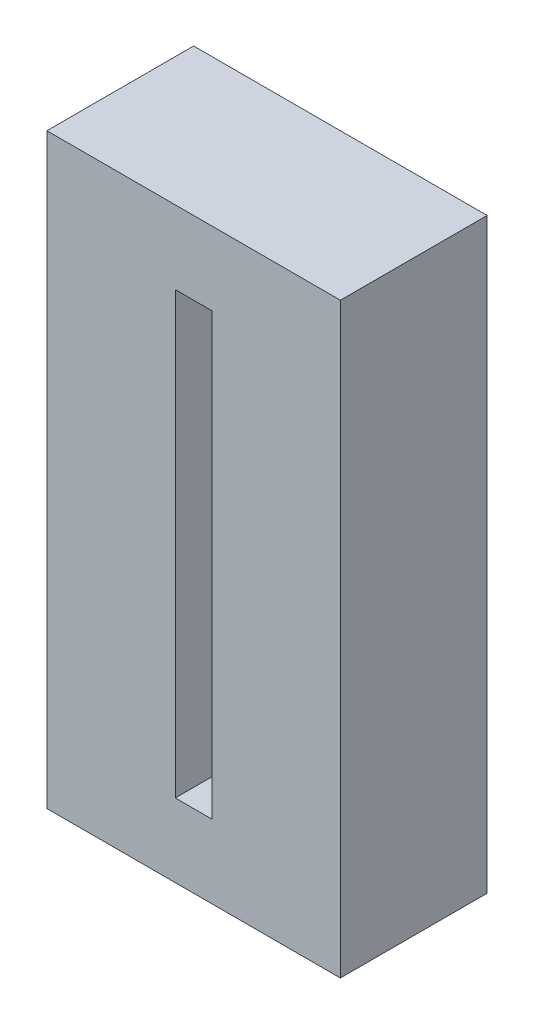
ISO-10303-21;
HEADER;
FILE_DESCRIPTION(('STEP AP214'),'2;1');
FILE_NAME('part.step','',(''),(''),'','','');
FILE_SCHEMA(('AUTOMOTIVE_DESIGN { 1 0 10303 214 1 1 1 1 }'));
ENDSEC;
DATA;
#1=APPLICATION_CONTEXT('core data for automotive mechanical design processes');
#2=APPLICATION_PROTOCOL_DEFINITION('international standard','automotive_design',2000,#1);
#3=PRODUCT_CONTEXT('',#1,'mechanical');
#4=PRODUCT('Part','Part','',(#3));
#5=PRODUCT_RELATED_PRODUCT_CATEGORY('part','',(#4));
#6=PRODUCT_DEFINITION_FORMATION('','',#4);
#7=PRODUCT_DEFINITION_CONTEXT('part definition',#1,'design');
#8=PRODUCT_DEFINITION('design','',#6,#7);
#9=PRODUCT_DEFINITION_SHAPE('','',#8);
#10=(LENGTH_UNIT() NAMED_UNIT(*) SI_UNIT(.MILLI.,.METRE.));
#11=(NAMED_UNIT(*) PLANE_ANGLE_UNIT() SI_UNIT($,.RADIAN.));
#12=(NAMED_UNIT(*) SI_UNIT($,.STERADIAN.) SOLID_ANGLE_UNIT());
#13=UNCERTAINTY_MEASURE_WITH_UNIT(LENGTH_MEASURE(1.E-05),#10,'distance_accuracy_value','');
#14=(GEOMETRIC_REPRESENTATION_CONTEXT(3) GLOBAL_UNCERTAINTY_ASSIGNED_CONTEXT((#13)) GLOBAL_UNIT_ASSIGNED_CONTEXT((#10,
#11,#12)) REPRESENTATION_CONTEXT('',''));
#15=CARTESIAN_POINT('',(0.,0.,0.));
#16=DIRECTION('',(0.,0.,1.));
#17=DIRECTION('',(1.,0.,0.));
#18=AXIS2_PLACEMENT_3D('',#15,#16,#17);
#19=CARTESIAN_POINT('',(0.,203.2,50.8));
#20=DIRECTION('',(0.,0.,-1.));
#21=DIRECTION('',(-1.,0.,0.));
#22=AXIS2_PLACEMENT_3D('',#19,#20,#21);
#23=PLANE('',#22);
#24=DIRECTION('',(0.,-1.,0.));
#25=VECTOR('',#24,1.);
#26=CARTESIAN_POINT('',(0.,0.,50.8));
#27=LINE('',#26,#25);
#28=CARTESIAN_POINT('',(0.,203.2,50.8));
#29=VERTEX_POINT('',#28);
#30=CARTESIAN_POINT('',(0.,0.,50.8));
#31=VERTEX_POINT('',#30);
#32=EDGE_CURVE('E133',#29,#31,#27,.T.);
#33=ORIENTED_EDGE('',*,*,#32,.T.);
#34=DIRECTION('',(1.,0.,0.));
#35=VECTOR('',#34,1.);
#36=CARTESIAN_POINT('',(0.,0.,50.8));
#37=LINE('',#36,#35);
#38=CARTESIAN_POINT('',(101.6,0.,50.8));
#39=VERTEX_POINT('',#38);
#40=EDGE_CURVE('E136',#31,#39,#37,.T.);
#41=ORIENTED_EDGE('',*,*,#40,.T.);
#42=DIRECTION('',(0.,1.,0.));
#43=VECTOR('',#42,1.);
#44=CARTESIAN_POINT('',(101.6,0.,50.8));
#45=LINE('',#44,#43);
#46=CARTESIAN_POINT('',(101.6,203.2,50.8));
#47=VERTEX_POINT('',#46);
#48=EDGE_CURVE('E139',#39,#47,#45,.T.);
#49=ORIENTED_EDGE('',*,*,#48,.T.);
#50=DIRECTION('',(-1.,0.,0.));
#51=VECTOR('',#50,1.);
#52=CARTESIAN_POINT('',(0.,203.2,50.8));
#53=LINE('',#52,#51);
#54=EDGE_CURVE('E141',#47,#29,#53,.T.);
#55=ORIENTED_EDGE('',*,*,#54,.T.);
#56=EDGE_LOOP('',(#33,#41,#49,#55));
#57=FACE_BOUND('',#56,.T.);
#58=DIRECTION('',(0.,-1.,0.));
#59=VECTOR('',#58,1.);
#60=CARTESIAN_POINT('',(44.45,25.4,50.8));
#61=LINE('',#60,#59);
#62=CARTESIAN_POINT('',(44.45,177.8,50.8));
#63=VERTEX_POINT('',#62);
#64=CARTESIAN_POINT('',(44.45,25.4,50.8));
#65=VERTEX_POINT('',#64);
#66=EDGE_CURVE('E97',#63,#65,#61,.T.);
#67=ORIENTED_EDGE('',*,*,#66,.F.);
#68=DIRECTION('',(-1.,0.,0.));
#69=VECTOR('',#68,1.);
#70=CARTESIAN_POINT('',(44.45,177.8,50.8));
#71=LINE('',#70,#69);
#72=CARTESIAN_POINT('',(57.15,177.8,50.8));
#73=VERTEX_POINT('',#72);
#74=EDGE_CURVE('E119',#73,#63,#71,.T.);
#75=ORIENTED_EDGE('',*,*,#74,.F.);
#76=DIRECTION('',(0.,1.,0.));
#77=VECTOR('',#76,1.);
#78=CARTESIAN_POINT('',(57.15,25.4,50.8));
#79=LINE('',#78,#77);
#80=CARTESIAN_POINT('',(57.15,25.4,50.8));
#81=VERTEX_POINT('',#80);
#82=EDGE_CURVE('E117',#81,#73,#79,.T.);
#83=ORIENTED_EDGE('',*,*,#82,.F.);
#84=DIRECTION('',(1.,0.,0.));
#85=VECTOR('',#84,1.);
#86=CARTESIAN_POINT('',(44.45,25.4,50.8));
#87=LINE('',#86,#85);
#88=EDGE_CURVE('E105',#65,#81,#87,.T.);
#89=ORIENTED_EDGE('',*,*,#88,.F.);
#90=EDGE_LOOP('',(#67,#75,#83,#89));
#91=FACE_BOUND('',#90,.T.);
#92=ADVANCED_FACE('F32',(#57,#91),#23,.F.);
#93=CARTESIAN_POINT('',(0.,203.2,0.));
#94=DIRECTION('',(0.,0.,-1.));
#95=DIRECTION('',(-1.,0.,0.));
#96=AXIS2_PLACEMENT_3D('',#93,#94,#95);
#97=PLANE('',#96);
#98=DIRECTION('',(0.,-1.,0.));
#99=VECTOR('',#98,1.);
#100=CARTESIAN_POINT('',(0.,0.,0.));
#101=LINE('',#100,#99);
#102=CARTESIAN_POINT('',(0.,203.2,0.));
#103=VERTEX_POINT('',#102);
#104=CARTESIAN_POINT('',(0.,0.,0.));
#105=VERTEX_POINT('',#104);
#106=EDGE_CURVE('E113',#103,#105,#101,.T.);
#107=ORIENTED_EDGE('',*,*,#106,.F.);
#108=DIRECTION('',(-1.,0.,0.));
#109=VECTOR('',#108,1.);
#110=CARTESIAN_POINT('',(0.,203.2,0.));
#111=LINE('',#110,#109);
#112=CARTESIAN_POINT('',(101.6,203.2,0.));
#113=VERTEX_POINT('',#112);
#114=EDGE_CURVE('E137',#113,#103,#111,.T.);
#115=ORIENTED_EDGE('',*,*,#114,.F.);
#116=DIRECTION('',(0.,1.,0.));
#117=VECTOR('',#116,1.);
#118=CARTESIAN_POINT('',(101.6,0.,0.));
#119=LINE('',#118,#117);
#120=CARTESIAN_POINT('',(101.6,0.,0.));
#121=VERTEX_POINT('',#120);
#122=EDGE_CURVE('E148',#121,#113,#119,.T.);
#123=ORIENTED_EDGE('',*,*,#122,.F.);
#124=DIRECTION('',(1.,0.,0.));
#125=VECTOR('',#124,1.);
#126=CARTESIAN_POINT('',(0.,0.,0.));
#127=LINE('',#126,#125);
#128=EDGE_CURVE('E146',#105,#121,#127,.T.);
#129=ORIENTED_EDGE('',*,*,#128,.F.);
#130=EDGE_LOOP('',(#107,#115,#123,#129));
#131=FACE_BOUND('',#130,.T.);
#132=DIRECTION('',(-1.,0.,0.));
#133=VECTOR('',#132,1.);
#134=CARTESIAN_POINT('',(44.45,177.8,0.));
#135=LINE('',#134,#133);
#136=CARTESIAN_POINT('',(57.15,177.8,0.));
#137=VERTEX_POINT('',#136);
#138=CARTESIAN_POINT('',(44.45,177.8,0.));
#139=VERTEX_POINT('',#138);
#140=EDGE_CURVE('E106',#137,#139,#135,.T.);
#141=ORIENTED_EDGE('',*,*,#140,.T.);
#142=DIRECTION('',(0.,-1.,0.));
#143=VECTOR('',#142,1.);
#144=CARTESIAN_POINT('',(44.45,25.4,0.));
#145=LINE('',#144,#143);
#146=CARTESIAN_POINT('',(44.45,25.4,0.));
#147=VERTEX_POINT('',#146);
#148=EDGE_CURVE('E55',#139,#147,#145,.T.);
#149=ORIENTED_EDGE('',*,*,#148,.T.);
#150=DIRECTION('',(1.,0.,0.));
#151=VECTOR('',#150,1.);
#152=CARTESIAN_POINT('',(44.45,25.4,0.));
#153=LINE('',#152,#151);
#154=CARTESIAN_POINT('',(57.15,25.4,0.));
#155=VERTEX_POINT('',#154);
#156=EDGE_CURVE('E112',#147,#155,#153,.T.);
#157=ORIENTED_EDGE('',*,*,#156,.T.);
#158=DIRECTION('',(0.,1.,0.));
#159=VECTOR('',#158,1.);
#160=CARTESIAN_POINT('',(57.15,25.4,0.));
#161=LINE('',#160,#159);
#162=EDGE_CURVE('E125',#155,#137,#161,.T.);
#163=ORIENTED_EDGE('',*,*,#162,.T.);
#164=EDGE_LOOP('',(#141,#149,#157,#163));
#165=FACE_BOUND('',#164,.T.);
#166=ADVANCED_FACE('F166',(#131,#165),#97,.T.);
#167=CARTESIAN_POINT('',(0.,0.,50.8));
#168=DIRECTION('',(1.,0.,0.));
#169=DIRECTION('',(0.,0.,-1.));
#170=AXIS2_PLACEMENT_3D('',#167,#168,#169);
#171=PLANE('',#170);
#172=ORIENTED_EDGE('',*,*,#106,.T.);
#173=DIRECTION('',(0.,0.,-1.));
#174=VECTOR('',#173,1.);
#175=CARTESIAN_POINT('',(0.,0.,50.8));
#176=LINE('',#175,#174);
#177=EDGE_CURVE('E11',#31,#105,#176,.T.);
#178=ORIENTED_EDGE('',*,*,#177,.F.);
#179=ORIENTED_EDGE('',*,*,#32,.F.);
#180=DIRECTION('',(0.,0.,-1.));
#181=VECTOR('',#180,1.);
#182=CARTESIAN_POINT('',(0.,203.2,50.8));
#183=LINE('',#182,#181);
#184=EDGE_CURVE('E143',#29,#103,#183,.T.);
#185=ORIENTED_EDGE('',*,*,#184,.T.);
#186=EDGE_LOOP('',(#172,#178,#179,#185));
#187=FACE_BOUND('',#186,.T.);
#188=ADVANCED_FACE('F34',(#187),#171,.F.);
#189=CARTESIAN_POINT('',(0.,0.,50.8));
#190=DIRECTION('',(0.,1.,0.));
#191=DIRECTION('',(0.,0.,1.));
#192=AXIS2_PLACEMENT_3D('',#189,#190,#191);
#193=PLANE('',#192);
#194=ORIENTED_EDGE('',*,*,#128,.T.);
#195=DIRECTION('',(0.,0.,-1.));
#196=VECTOR('',#195,1.);
#197=CARTESIAN_POINT('',(101.6,0.,50.8));
#198=LINE('',#197,#196);
#199=EDGE_CURVE('E40',#39,#121,#198,.T.);
#200=ORIENTED_EDGE('',*,*,#199,.F.);
#201=ORIENTED_EDGE('',*,*,#40,.F.);
#202=ORIENTED_EDGE('',*,*,#177,.T.);
#203=EDGE_LOOP('',(#194,#200,#201,#202));
#204=FACE_BOUND('',#203,.T.);
#205=ADVANCED_FACE('F176',(#204),#193,.F.);
#206=CARTESIAN_POINT('',(101.6,0.,50.8));
#207=DIRECTION('',(-1.,0.,0.));
#208=DIRECTION('',(0.,0.,1.));
#209=AXIS2_PLACEMENT_3D('',#206,#207,#208);
#210=PLANE('',#209);
#211=ORIENTED_EDGE('',*,*,#122,.T.);
#212=DIRECTION('',(0.,0.,-1.));
#213=VECTOR('',#212,1.);
#214=CARTESIAN_POINT('',(101.6,203.2,50.8));
#215=LINE('',#214,#213);
#216=EDGE_CURVE('E153',#47,#113,#215,.T.);
#217=ORIENTED_EDGE('',*,*,#216,.F.);
#218=ORIENTED_EDGE('',*,*,#48,.F.);
#219=ORIENTED_EDGE('',*,*,#199,.T.);
#220=EDGE_LOOP('',(#211,#217,#218,#219));
#221=FACE_BOUND('',#220,.T.);
#222=ADVANCED_FACE('F160',(#221),#210,.F.);
#223=CARTESIAN_POINT('',(0.,203.2,50.8));
#224=DIRECTION('',(0.,-1.,0.));
#225=DIRECTION('',(0.,0.,-1.));
#226=AXIS2_PLACEMENT_3D('',#223,#224,#225);
#227=PLANE('',#226);
#228=ORIENTED_EDGE('',*,*,#114,.T.);
#229=ORIENTED_EDGE('',*,*,#184,.F.);
#230=ORIENTED_EDGE('',*,*,#54,.F.);
#231=ORIENTED_EDGE('',*,*,#216,.T.);
#232=EDGE_LOOP('',(#228,#229,#230,#231));
#233=FACE_BOUND('',#232,.T.);
#234=ADVANCED_FACE('F170',(#233),#227,.F.);
#235=CARTESIAN_POINT('',(44.45,25.4,50.8));
#236=DIRECTION('',(1.,0.,0.));
#237=DIRECTION('',(0.,0.,-1.));
#238=AXIS2_PLACEMENT_3D('',#235,#236,#237);
#239=PLANE('',#238);
#240=ORIENTED_EDGE('',*,*,#148,.F.);
#241=DIRECTION('',(0.,0.,-1.));
#242=VECTOR('',#241,1.);
#243=CARTESIAN_POINT('',(44.45,177.8,50.8));
#244=LINE('',#243,#242);
#245=EDGE_CURVE('E101',#63,#139,#244,.T.);
#246=ORIENTED_EDGE('',*,*,#245,.F.);
#247=ORIENTED_EDGE('',*,*,#66,.T.);
#248=DIRECTION('',(0.,0.,-1.));
#249=VECTOR('',#248,1.);
#250=CARTESIAN_POINT('',(44.45,25.4,50.8));
#251=LINE('',#250,#249);
#252=EDGE_CURVE('E100',#65,#147,#251,.T.);
#253=ORIENTED_EDGE('',*,*,#252,.T.);
#254=EDGE_LOOP('',(#240,#246,#247,#253));
#255=FACE_BOUND('',#254,.T.);
#256=ADVANCED_FACE('F99',(#255),#239,.T.);
#257=CARTESIAN_POINT('',(44.45,25.4,50.8));
#258=DIRECTION('',(0.,1.,0.));
#259=DIRECTION('',(0.,0.,1.));
#260=AXIS2_PLACEMENT_3D('',#257,#258,#259);
#261=PLANE('',#260);
#262=ORIENTED_EDGE('',*,*,#156,.F.);
#263=ORIENTED_EDGE('',*,*,#252,.F.);
#264=ORIENTED_EDGE('',*,*,#88,.T.);
#265=DIRECTION('',(0.,0.,-1.));
#266=VECTOR('',#265,1.);
#267=CARTESIAN_POINT('',(57.15,25.4,50.8));
#268=LINE('',#267,#266);
#269=EDGE_CURVE('E114',#81,#155,#268,.T.);
#270=ORIENTED_EDGE('',*,*,#269,.T.);
#271=EDGE_LOOP('',(#262,#263,#264,#270));
#272=FACE_BOUND('',#271,.T.);
#273=ADVANCED_FACE('F109',(#272),#261,.T.);
#274=CARTESIAN_POINT('',(57.15,25.4,50.8));
#275=DIRECTION('',(-1.,0.,0.));
#276=DIRECTION('',(0.,0.,1.));
#277=AXIS2_PLACEMENT_3D('',#274,#275,#276);
#278=PLANE('',#277);
#279=ORIENTED_EDGE('',*,*,#162,.F.);
#280=ORIENTED_EDGE('',*,*,#269,.F.);
#281=ORIENTED_EDGE('',*,*,#82,.T.);
#282=DIRECTION('',(0.,0.,-1.));
#283=VECTOR('',#282,1.);
#284=CARTESIAN_POINT('',(57.15,177.8,50.8));
#285=LINE('',#284,#283);
#286=EDGE_CURVE('E47',#73,#137,#285,.T.);
#287=ORIENTED_EDGE('',*,*,#286,.T.);
#288=EDGE_LOOP('',(#279,#280,#281,#287));
#289=FACE_BOUND('',#288,.T.);
#290=ADVANCED_FACE('F199',(#289),#278,.T.);
#291=CARTESIAN_POINT('',(44.45,177.8,50.8));
#292=DIRECTION('',(0.,-1.,0.));
#293=DIRECTION('',(0.,0.,-1.));
#294=AXIS2_PLACEMENT_3D('',#291,#292,#293);
#295=PLANE('',#294);
#296=ORIENTED_EDGE('',*,*,#140,.F.);
#297=ORIENTED_EDGE('',*,*,#286,.F.);
#298=ORIENTED_EDGE('',*,*,#74,.T.);
#299=ORIENTED_EDGE('',*,*,#245,.T.);
#300=EDGE_LOOP('',(#296,#297,#298,#299));
#301=FACE_BOUND('',#300,.T.);
#302=ADVANCED_FACE('F203',(#301),#295,.T.);
#303=CLOSED_SHELL('',(#92,#166,#188,#205,#222,#234,#256,#273,#290,#302));
#304=MANIFOLD_SOLID_BREP('B2',#303);
#305=ADVANCED_BREP_SHAPE_REPRESENTATION('',(#18,#304),#14);
#306=SHAPE_DEFINITION_REPRESENTATION(#9,#305);
ENDSEC;
END-ISO-10303-21;
